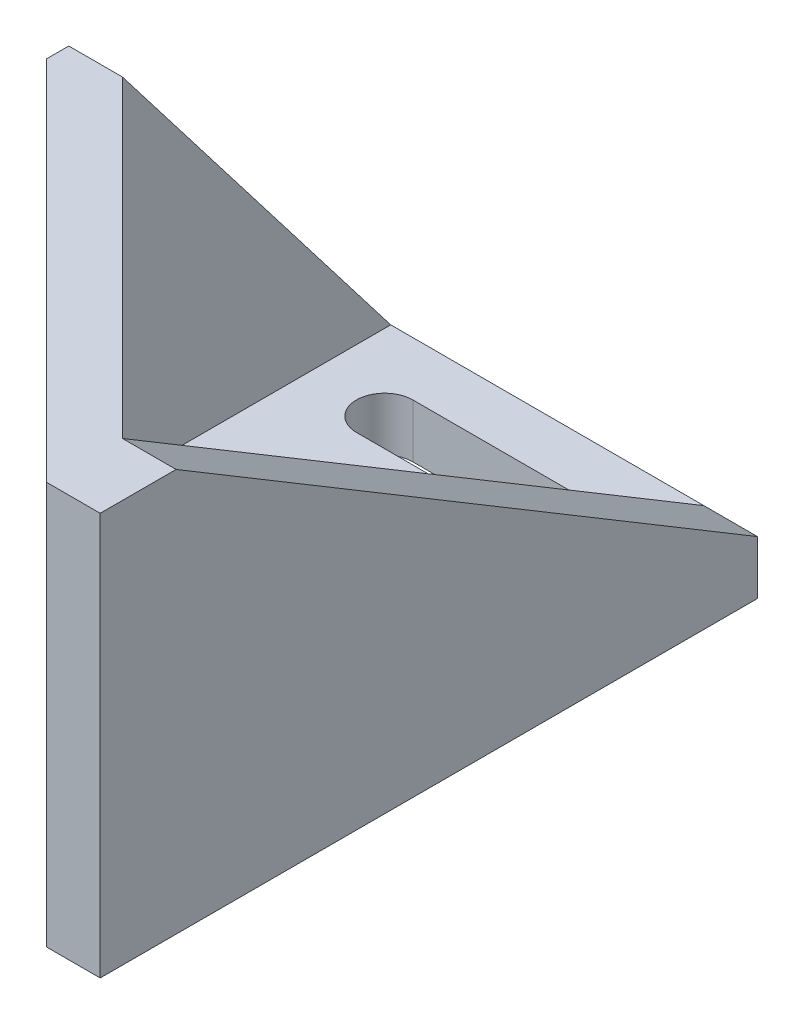
ISO-10303-21;
HEADER;
FILE_DESCRIPTION(('STEP AP214'),'2;1');
FILE_NAME('part.step','',(''),(''),'','','');
FILE_SCHEMA(('AUTOMOTIVE_DESIGN { 1 0 10303 214 1 1 1 1 }'));
ENDSEC;
DATA;
#1=APPLICATION_CONTEXT('core data for automotive mechanical design processes');
#2=APPLICATION_PROTOCOL_DEFINITION('international standard','automotive_design',2000,#1);
#3=PRODUCT_CONTEXT('',#1,'mechanical');
#4=PRODUCT('Part','Part','',(#3));
#5=PRODUCT_RELATED_PRODUCT_CATEGORY('part','',(#4));
#6=PRODUCT_DEFINITION_FORMATION('','',#4);
#7=PRODUCT_DEFINITION_CONTEXT('part definition',#1,'design');
#8=PRODUCT_DEFINITION('design','',#6,#7);
#9=PRODUCT_DEFINITION_SHAPE('','',#8);
#10=(LENGTH_UNIT() NAMED_UNIT(*) SI_UNIT(.MILLI.,.METRE.));
#11=(NAMED_UNIT(*) PLANE_ANGLE_UNIT() SI_UNIT($,.RADIAN.));
#12=(NAMED_UNIT(*) SI_UNIT($,.STERADIAN.) SOLID_ANGLE_UNIT());
#13=UNCERTAINTY_MEASURE_WITH_UNIT(LENGTH_MEASURE(1.E-05),#10,'distance_accuracy_value','');
#14=(GEOMETRIC_REPRESENTATION_CONTEXT(3) GLOBAL_UNCERTAINTY_ASSIGNED_CONTEXT((#13)) GLOBAL_UNIT_ASSIGNED_CONTEXT((#10,
#11,#12)) REPRESENTATION_CONTEXT('',''));
#15=CARTESIAN_POINT('',(0.,0.,0.));
#16=DIRECTION('',(0.,0.,1.));
#17=DIRECTION('',(1.,0.,0.));
#18=AXIS2_PLACEMENT_3D('',#15,#16,#17);
#19=CARTESIAN_POINT('',(-3.32462120245872,15.3749999999991,-1.52462120245878));
#20=DIRECTION('',(-0.707106781186548,0.,0.707106781186547));
#21=DIRECTION('',(0.707106781186547,0.,0.707106781186548));
#22=AXIS2_PLACEMENT_3D('',#19,#20,#21);
#23=CYLINDRICAL_SURFACE('',#22,2.05);
#24=CARTESIAN_POINT('',(-10.2530483272049,15.3749999999991,5.40380592228742));
#25=DIRECTION('',(-0.707106781186548,0.,0.707106781186547));
#26=DIRECTION('',(0.707106781186547,0.,0.707106781186548));
#27=AXIS2_PLACEMENT_3D('',#24,#25,#26);
#28=CIRCLE('',#27,2.05);
#29=CARTESIAN_POINT('',(-8.8034794257725,15.3749999999991,6.85337482371984));
#30=VERTEX_POINT('',#29);
#31=EDGE_CURVE('E397',#30,#30,#28,.T.);
#32=ORIENTED_EDGE('',*,*,#31,.T.);
#33=EDGE_LOOP('',(#32));
#34=FACE_BOUND('',#33,.T.);
#35=CARTESIAN_POINT('',(-8.83883476483183,15.3749999999991,3.98959235991433));
#36=DIRECTION('',(0.707106781186548,0.,-0.707106781186548));
#37=DIRECTION('',(-0.707106781186548,0.,-0.707106781186548));
#38=AXIS2_PLACEMENT_3D('',#35,#36,#37);
#39=CIRCLE('',#38,2.05);
#40=CARTESIAN_POINT('',(-10.2884036662643,15.3749999999991,2.54002345848191));
#41=VERTEX_POINT('',#40);
#42=EDGE_CURVE('E39',#41,#41,#39,.F.);
#43=ORIENTED_EDGE('',*,*,#42,.F.);
#44=EDGE_LOOP('',(#43));
#45=FACE_BOUND('',#44,.T.);
#46=ADVANCED_FACE('F35',(#34,#45),#23,.F.);
#47=CARTESIAN_POINT('',(11.5246212024588,15.3749999999991,13.3246212024587));
#48=DIRECTION('',(-0.707106781186548,0.,0.707106781186547));
#49=DIRECTION('',(0.707106781186547,0.,0.707106781186548));
#50=AXIS2_PLACEMENT_3D('',#47,#48,#49);
#51=CYLINDRICAL_SURFACE('',#50,2.05);
#52=CARTESIAN_POINT('',(4.59619407771259,15.3749999999991,20.2530483272049));
#53=DIRECTION('',(-0.707106781186548,0.,0.707106781186547));
#54=DIRECTION('',(0.707106781186547,0.,0.707106781186548));
#55=AXIS2_PLACEMENT_3D('',#52,#53,#54);
#56=CIRCLE('',#55,2.05);
#57=CARTESIAN_POINT('',(6.04576297914501,15.3749999999991,21.7026172286374));
#58=VERTEX_POINT('',#57);
#59=EDGE_CURVE('E388',#58,#58,#56,.T.);
#60=ORIENTED_EDGE('',*,*,#59,.T.);
#61=EDGE_LOOP('',(#60));
#62=FACE_BOUND('',#61,.T.);
#63=CARTESIAN_POINT('',(6.01040764008569,15.3749999999991,18.8388347648318));
#64=DIRECTION('',(0.707106781186547,0.,-0.707106781186548));
#65=DIRECTION('',(-0.707106781186548,0.,-0.707106781186547));
#66=AXIS2_PLACEMENT_3D('',#63,#64,#65);
#67=CIRCLE('',#66,2.05);
#68=CARTESIAN_POINT('',(4.56083873865326,15.3749999999991,17.3892658633994));
#69=VERTEX_POINT('',#68);
#70=EDGE_CURVE('E320',#69,#69,#67,.F.);
#71=ORIENTED_EDGE('',*,*,#70,.F.);
#72=EDGE_LOOP('',(#71));
#73=FACE_BOUND('',#72,.T.);
#74=ADVANCED_FACE('F475',(#62,#73),#51,.F.);
#75=CARTESIAN_POINT('',(-11.667261889578,4.,-21.6672618895781));
#76=DIRECTION('',(0.,0.,1.));
#77=DIRECTION('',(1.,0.,0.));
#78=AXIS2_PLACEMENT_3D('',#75,#76,#77);
#79=PLANE('',#78);
#80=DIRECTION('',(-1.,0.,0.));
#81=VECTOR('',#80,1.);
#82=CARTESIAN_POINT('',(-11.667261889578,0.,-21.6672618895781));
#83=LINE('',#82,#81);
#84=CARTESIAN_POINT('',(15.667261889578,0.,-21.6672618895781));
#85=VERTEX_POINT('',#84);
#86=CARTESIAN_POINT('',(-15.667261889578,0.,-21.6672618895781));
#87=VERTEX_POINT('',#86);
#88=EDGE_CURVE('E457',#85,#87,#83,.T.);
#89=ORIENTED_EDGE('',*,*,#88,.T.);
#90=DIRECTION('',(0.,-1.,0.));
#91=VECTOR('',#90,1.);
#92=CARTESIAN_POINT('',(-15.667261889578,4.,-21.6672618895781));
#93=LINE('',#92,#91);
#94=CARTESIAN_POINT('',(-15.667261889578,4.,-21.6672618895781));
#95=VERTEX_POINT('',#94);
#96=EDGE_CURVE('E408',#95,#87,#93,.T.);
#97=ORIENTED_EDGE('',*,*,#96,.F.);
#98=DIRECTION('',(1.,0.,0.));
#99=VECTOR('',#98,1.);
#100=CARTESIAN_POINT('',(-15.667261889578,4.,-21.6672618895781));
#101=LINE('',#100,#99);
#102=CARTESIAN_POINT('',(-11.667261889578,4.,-21.6672618895781));
#103=VERTEX_POINT('',#102);
#104=EDGE_CURVE('E414',#95,#103,#101,.T.);
#105=ORIENTED_EDGE('',*,*,#104,.T.);
#106=DIRECTION('',(-1.,0.,0.));
#107=VECTOR('',#106,1.);
#108=CARTESIAN_POINT('',(-11.667261889578,4.,-21.6672618895781));
#109=LINE('',#108,#107);
#110=CARTESIAN_POINT('',(11.667261889578,4.,-21.6672618895781));
#111=VERTEX_POINT('',#110);
#112=EDGE_CURVE('E465',#111,#103,#109,.T.);
#113=ORIENTED_EDGE('',*,*,#112,.F.);
#114=DIRECTION('',(-1.,0.,0.));
#115=VECTOR('',#114,1.);
#116=CARTESIAN_POINT('',(15.667261889578,4.,-21.6672618895781));
#117=LINE('',#116,#115);
#118=CARTESIAN_POINT('',(15.667261889578,4.,-21.6672618895781));
#119=VERTEX_POINT('',#118);
#120=EDGE_CURVE('E440',#119,#111,#117,.T.);
#121=ORIENTED_EDGE('',*,*,#120,.F.);
#122=DIRECTION('',(0.,1.,0.));
#123=VECTOR('',#122,1.);
#124=CARTESIAN_POINT('',(15.667261889578,4.,-21.6672618895781));
#125=LINE('',#124,#123);
#126=EDGE_CURVE('E431',#85,#119,#125,.T.);
#127=ORIENTED_EDGE('',*,*,#126,.F.);
#128=EDGE_LOOP('',(#89,#97,#105,#113,#121,#127));
#129=FACE_BOUND('',#128,.T.);
#130=ADVANCED_FACE('F37',(#129),#79,.F.);
#131=CARTESIAN_POINT('',(0.,4.,0.));
#132=DIRECTION('',(0.,-1.,0.));
#133=DIRECTION('',(0.,0.,-1.));
#134=AXIS2_PLACEMENT_3D('',#131,#132,#133);
#135=PLANE('',#134);
#136=DIRECTION('',(1.,0.,0.));
#137=VECTOR('',#136,1.);
#138=CARTESIAN_POINT('',(-6.,4.,-3.44425381419345));
#139=LINE('',#138,#137);
#140=CARTESIAN_POINT('',(-6.,4.,-3.44425381419345));
#141=VERTEX_POINT('',#140);
#142=CARTESIAN_POINT('',(6.,4.,-3.44425381419345));
#143=VERTEX_POINT('',#142);
#144=EDGE_CURVE('E346',#141,#143,#139,.T.);
#145=ORIENTED_EDGE('',*,*,#144,.F.);
#146=CARTESIAN_POINT('',(-6.,4.,-5.54425381419345));
#147=DIRECTION('',(0.,1.,0.));
#148=DIRECTION('',(0.,0.,1.));
#149=AXIS2_PLACEMENT_3D('',#146,#147,#148);
#150=CIRCLE('',#149,2.1);
#151=CARTESIAN_POINT('',(-6.,4.,-7.64425381419345));
#152=VERTEX_POINT('',#151);
#153=EDGE_CURVE('E344',#152,#141,#150,.T.);
#154=ORIENTED_EDGE('',*,*,#153,.F.);
#155=DIRECTION('',(-1.,0.,0.));
#156=VECTOR('',#155,1.);
#157=CARTESIAN_POINT('',(-6.,4.,-7.64425381419345));
#158=LINE('',#157,#156);
#159=CARTESIAN_POINT('',(6.,4.,-7.64425381419345));
#160=VERTEX_POINT('',#159);
#161=EDGE_CURVE('E334',#160,#152,#158,.T.);
#162=ORIENTED_EDGE('',*,*,#161,.F.);
#163=CARTESIAN_POINT('',(6.,4.,-5.54425381419345));
#164=DIRECTION('',(0.,1.,0.));
#165=DIRECTION('',(0.,0.,1.));
#166=AXIS2_PLACEMENT_3D('',#163,#164,#165);
#167=CIRCLE('',#166,2.1);
#168=EDGE_CURVE('E349',#143,#160,#167,.T.);
#169=ORIENTED_EDGE('',*,*,#168,.F.);
#170=EDGE_LOOP('',(#145,#154,#162,#169));
#171=FACE_BOUND('',#170,.T.);
#172=DIRECTION('',(1.,0.,0.));
#173=VECTOR('',#172,1.);
#174=CARTESIAN_POINT('',(-6.,4.,-13.4442538141935));
#175=LINE('',#174,#173);
#176=CARTESIAN_POINT('',(-6.,4.,-13.4442538141935));
#177=VERTEX_POINT('',#176);
#178=CARTESIAN_POINT('',(6.,4.,-13.4442538141935));
#179=VERTEX_POINT('',#178);
#180=EDGE_CURVE('E378',#177,#179,#175,.T.);
#181=ORIENTED_EDGE('',*,*,#180,.F.);
#182=CARTESIAN_POINT('',(-6.,4.,-15.5442538141935));
#183=DIRECTION('',(0.,1.,0.));
#184=DIRECTION('',(0.,0.,1.));
#185=AXIS2_PLACEMENT_3D('',#182,#183,#184);
#186=CIRCLE('',#185,2.1);
#187=CARTESIAN_POINT('',(-6.,4.,-17.6442538141935));
#188=VERTEX_POINT('',#187);
#189=EDGE_CURVE('E356',#188,#177,#186,.T.);
#190=ORIENTED_EDGE('',*,*,#189,.F.);
#191=DIRECTION('',(-1.,0.,0.));
#192=VECTOR('',#191,1.);
#193=CARTESIAN_POINT('',(-6.,4.,-17.6442538141935));
#194=LINE('',#193,#192);
#195=CARTESIAN_POINT('',(6.,4.,-17.6442538141935));
#196=VERTEX_POINT('',#195);
#197=EDGE_CURVE('E367',#196,#188,#194,.T.);
#198=ORIENTED_EDGE('',*,*,#197,.F.);
#199=CARTESIAN_POINT('',(6.,4.,-15.5442538141935));
#200=DIRECTION('',(0.,1.,0.));
#201=DIRECTION('',(0.,0.,1.));
#202=AXIS2_PLACEMENT_3D('',#199,#200,#201);
#203=CIRCLE('',#202,2.1);
#204=EDGE_CURVE('E381',#179,#196,#203,.T.);
#205=ORIENTED_EDGE('',*,*,#204,.F.);
#206=EDGE_LOOP('',(#181,#190,#198,#205));
#207=FACE_BOUND('',#206,.T.);
#208=DIRECTION('',(0.,0.,-1.));
#209=VECTOR('',#208,1.);
#210=CARTESIAN_POINT('',(11.667261889578,4.,21.6672618895781));
#211=LINE('',#210,#209);
#212=CARTESIAN_POINT('',(11.667261889578,4.,21.6672618895781));
#213=VERTEX_POINT('',#212);
#214=EDGE_CURVE('E462',#213,#111,#211,.T.);
#215=ORIENTED_EDGE('',*,*,#214,.T.);
#216=ORIENTED_EDGE('',*,*,#112,.T.);
#217=DIRECTION('',(0.,0.,1.));
#218=VECTOR('',#217,1.);
#219=CARTESIAN_POINT('',(-11.667261889578,4.,-21.6672618895781));
#220=LINE('',#219,#218);
#221=CARTESIAN_POINT('',(-11.667261889578,4.,-1.66726188957805));
#222=VERTEX_POINT('',#221);
#223=EDGE_CURVE('E44',#103,#222,#220,.T.);
#224=ORIENTED_EDGE('',*,*,#223,.T.);
#225=DIRECTION('',(0.707106781186546,0.,0.707106781186549));
#226=VECTOR('',#225,1.);
#227=CARTESIAN_POINT('',(-11.667261889578,4.,-1.66726188957805));
#228=LINE('',#227,#226);
#229=EDGE_CURVE('E11',#222,#213,#228,.T.);
#230=ORIENTED_EDGE('',*,*,#229,.T.);
#231=EDGE_LOOP('',(#215,#216,#224,#230));
#232=FACE_BOUND('',#231,.T.);
#233=ADVANCED_FACE('F483',(#171,#207,#232),#135,.F.);
#234=CARTESIAN_POINT('',(0.,0.,0.));
#235=DIRECTION('',(0.,-1.,0.));
#236=DIRECTION('',(0.,0.,-1.));
#237=AXIS2_PLACEMENT_3D('',#234,#235,#236);
#238=PLANE('',#237);
#239=CARTESIAN_POINT('',(-6.,0.,-5.54425381419345));
#240=DIRECTION('',(0.,1.,0.));
#241=DIRECTION('',(0.,0.,1.));
#242=AXIS2_PLACEMENT_3D('',#239,#240,#241);
#243=CIRCLE('',#242,2.1);
#244=CARTESIAN_POINT('',(-6.,0.,-7.64425381419345));
#245=VERTEX_POINT('',#244);
#246=CARTESIAN_POINT('',(-6.,0.,-3.44425381419345));
#247=VERTEX_POINT('',#246);
#248=EDGE_CURVE('E330',#245,#247,#243,.T.);
#249=ORIENTED_EDGE('',*,*,#248,.T.);
#250=DIRECTION('',(1.,0.,0.));
#251=VECTOR('',#250,1.);
#252=CARTESIAN_POINT('',(-6.,0.,-3.44425381419345));
#253=LINE('',#252,#251);
#254=CARTESIAN_POINT('',(6.,0.,-3.44425381419345));
#255=VERTEX_POINT('',#254);
#256=EDGE_CURVE('E333',#247,#255,#253,.T.);
#257=ORIENTED_EDGE('',*,*,#256,.T.);
#258=CARTESIAN_POINT('',(6.,0.,-5.54425381419345));
#259=DIRECTION('',(0.,1.,0.));
#260=DIRECTION('',(0.,0.,1.));
#261=AXIS2_PLACEMENT_3D('',#258,#259,#260);
#262=CIRCLE('',#261,2.1);
#263=CARTESIAN_POINT('',(6.,0.,-7.64425381419345));
#264=VERTEX_POINT('',#263);
#265=EDGE_CURVE('E337',#255,#264,#262,.T.);
#266=ORIENTED_EDGE('',*,*,#265,.T.);
#267=DIRECTION('',(-1.,0.,0.));
#268=VECTOR('',#267,1.);
#269=CARTESIAN_POINT('',(-6.,0.,-7.64425381419345));
#270=LINE('',#269,#268);
#271=EDGE_CURVE('E340',#264,#245,#270,.T.);
#272=ORIENTED_EDGE('',*,*,#271,.T.);
#273=EDGE_LOOP('',(#249,#257,#266,#272));
#274=FACE_BOUND('',#273,.T.);
#275=CARTESIAN_POINT('',(-6.,0.,-15.5442538141935));
#276=DIRECTION('',(0.,1.,0.));
#277=DIRECTION('',(0.,0.,1.));
#278=AXIS2_PLACEMENT_3D('',#275,#276,#277);
#279=CIRCLE('',#278,2.1);
#280=CARTESIAN_POINT('',(-6.,0.,-17.6442538141935));
#281=VERTEX_POINT('',#280);
#282=CARTESIAN_POINT('',(-6.,0.,-13.4442538141935));
#283=VERTEX_POINT('',#282);
#284=EDGE_CURVE('E363',#281,#283,#279,.T.);
#285=ORIENTED_EDGE('',*,*,#284,.T.);
#286=DIRECTION('',(1.,0.,0.));
#287=VECTOR('',#286,1.);
#288=CARTESIAN_POINT('',(-6.,0.,-13.4442538141935));
#289=LINE('',#288,#287);
#290=CARTESIAN_POINT('',(6.,0.,-13.4442538141935));
#291=VERTEX_POINT('',#290);
#292=EDGE_CURVE('E366',#283,#291,#289,.T.);
#293=ORIENTED_EDGE('',*,*,#292,.T.);
#294=CARTESIAN_POINT('',(6.,0.,-15.5442538141935));
#295=DIRECTION('',(0.,1.,0.));
#296=DIRECTION('',(0.,0.,1.));
#297=AXIS2_PLACEMENT_3D('',#294,#295,#296);
#298=CIRCLE('',#297,2.1);
#299=CARTESIAN_POINT('',(6.,0.,-17.6442538141935));
#300=VERTEX_POINT('',#299);
#301=EDGE_CURVE('E370',#291,#300,#298,.T.);
#302=ORIENTED_EDGE('',*,*,#301,.T.);
#303=DIRECTION('',(-1.,0.,0.));
#304=VECTOR('',#303,1.);
#305=CARTESIAN_POINT('',(-6.,0.,-17.6442538141935));
#306=LINE('',#305,#304);
#307=EDGE_CURVE('E373',#300,#281,#306,.T.);
#308=ORIENTED_EDGE('',*,*,#307,.T.);
#309=EDGE_LOOP('',(#285,#293,#302,#308));
#310=FACE_BOUND('',#309,.T.);
#311=DIRECTION('',(-0.707106781186547,0.,-0.707106781186548));
#312=VECTOR('',#311,1.);
#313=CARTESIAN_POINT('',(-11.667261889578,0.,3.98959235991432));
#314=LINE('',#313,#312);
#315=CARTESIAN_POINT('',(11.667261889578,0.,27.3241161390704));
#316=VERTEX_POINT('',#315);
#317=CARTESIAN_POINT('',(-15.667261889578,0.,-0.0104076400856811));
#318=VERTEX_POINT('',#317);
#319=EDGE_CURVE('E447',#316,#318,#314,.T.);
#320=ORIENTED_EDGE('',*,*,#319,.T.);
#321=DIRECTION('',(0.,0.,1.));
#322=VECTOR('',#321,1.);
#323=CARTESIAN_POINT('',(-15.667261889578,0.,-21.6672618895781));
#324=LINE('',#323,#322);
#325=EDGE_CURVE('E411',#87,#318,#324,.T.);
#326=ORIENTED_EDGE('',*,*,#325,.F.);
#327=ORIENTED_EDGE('',*,*,#88,.F.);
#328=DIRECTION('',(0.,0.,-1.));
#329=VECTOR('',#328,1.);
#330=CARTESIAN_POINT('',(15.667261889578,0.,27.3241161390704));
#331=LINE('',#330,#329);
#332=CARTESIAN_POINT('',(15.667261889578,0.,27.3241161390704));
#333=VERTEX_POINT('',#332);
#334=EDGE_CURVE('E428',#333,#85,#331,.T.);
#335=ORIENTED_EDGE('',*,*,#334,.F.);
#336=DIRECTION('',(-1.,0.,0.));
#337=VECTOR('',#336,1.);
#338=CARTESIAN_POINT('',(15.667261889578,0.,27.3241161390704));
#339=LINE('',#338,#337);
#340=EDGE_CURVE('E442',#333,#316,#339,.T.);
#341=ORIENTED_EDGE('',*,*,#340,.T.);
#342=EDGE_LOOP('',(#320,#326,#327,#335,#341));
#343=FACE_BOUND('',#342,.T.);
#344=ADVANCED_FACE('F530',(#274,#310,#343),#238,.T.);
#345=CARTESIAN_POINT('',(11.667261889578,30.,21.667261889578));
#346=DIRECTION('',(0.707106781186547,0.,-0.707106781186547));
#347=DIRECTION('',(-0.707106781186548,0.,-0.707106781186548));
#348=AXIS2_PLACEMENT_3D('',#345,#346,#347);
#349=PLANE('',#348);
#350=DIRECTION('',(0.353553390593274,-0.866025403784439,0.353553390593274));
#351=VECTOR('',#350,1.);
#352=CARTESIAN_POINT('',(-6.0161646003584,18.8249999999991,3.98383539964156));
#353=LINE('',#352,#351);
#354=CARTESIAN_POINT('',(-6.0161646003584,18.8249999999991,3.98383539964156));
#355=VERTEX_POINT('',#354);
#356=CARTESIAN_POINT('',(-4.60770799825808,15.3749999999991,5.39229200174189));
#357=VERTEX_POINT('',#356);
#358=EDGE_CURVE('E52',#355,#357,#353,.T.);
#359=ORIENTED_EDGE('',*,*,#358,.F.);
#360=DIRECTION('',(0.707106781186547,0.,0.707106781186548));
#361=VECTOR('',#360,1.);
#362=CARTESIAN_POINT('',(-8.83307780455906,18.8249999999991,1.16692219544091));
#363=LINE('',#362,#361);
#364=CARTESIAN_POINT('',(-8.83307780455906,18.8249999999991,1.16692219544091));
#365=VERTEX_POINT('',#364);
#366=EDGE_CURVE('E250',#365,#355,#363,.T.);
#367=ORIENTED_EDGE('',*,*,#366,.F.);
#368=DIRECTION('',(0.353553390593274,0.866025403784439,0.353553390593274));
#369=VECTOR('',#368,1.);
#370=CARTESIAN_POINT('',(-10.2415344066594,15.3749999999991,-0.24153440665942));
#371=LINE('',#370,#369);
#372=CARTESIAN_POINT('',(-10.2415344066594,15.3749999999991,-0.24153440665942));
#373=VERTEX_POINT('',#372);
#374=EDGE_CURVE('E253',#373,#365,#371,.T.);
#375=ORIENTED_EDGE('',*,*,#374,.F.);
#376=DIRECTION('',(-0.353553390593273,0.866025403784439,-0.353553390593273));
#377=VECTOR('',#376,1.);
#378=CARTESIAN_POINT('',(-8.83307780455906,11.9249999999991,1.16692219544091));
#379=LINE('',#378,#377);
#380=CARTESIAN_POINT('',(-8.83307780455906,11.9249999999991,1.16692219544091));
#381=VERTEX_POINT('',#380);
#382=EDGE_CURVE('E269',#381,#373,#379,.T.);
#383=ORIENTED_EDGE('',*,*,#382,.F.);
#384=DIRECTION('',(-0.707106781186548,0.,-0.707106781186548));
#385=VECTOR('',#384,1.);
#386=CARTESIAN_POINT('',(-6.0161646003584,11.9249999999991,3.98383539964156));
#387=LINE('',#386,#385);
#388=CARTESIAN_POINT('',(-6.0161646003584,11.9249999999991,3.98383539964156));
#389=VERTEX_POINT('',#388);
#390=EDGE_CURVE('E266',#389,#381,#387,.T.);
#391=ORIENTED_EDGE('',*,*,#390,.F.);
#392=DIRECTION('',(-0.353553390593274,-0.866025403784439,-0.353553390593274));
#393=VECTOR('',#392,1.);
#394=CARTESIAN_POINT('',(-4.60770799825808,15.3749999999991,5.39229200174189));
#395=LINE('',#394,#393);
#396=EDGE_CURVE('E264',#357,#389,#395,.T.);
#397=ORIENTED_EDGE('',*,*,#396,.F.);
#398=EDGE_LOOP('',(#359,#367,#375,#383,#391,#397));
#399=FACE_BOUND('',#398,.T.);
#400=DIRECTION('',(-0.353553390593273,0.866025403784439,-0.353553390593273));
#401=VECTOR('',#400,1.);
#402=CARTESIAN_POINT('',(6.01616460035846,11.9249999999991,16.0161646003584));
#403=LINE('',#402,#401);
#404=CARTESIAN_POINT('',(6.01616460035846,11.9249999999991,16.0161646003584));
#405=VERTEX_POINT('',#404);
#406=CARTESIAN_POINT('',(4.60770799825813,15.3749999999991,14.6077079982581));
#407=VERTEX_POINT('',#406);
#408=EDGE_CURVE('E60',#405,#407,#403,.T.);
#409=ORIENTED_EDGE('',*,*,#408,.F.);
#410=DIRECTION('',(-0.707106781186547,0.,-0.707106781186548));
#411=VECTOR('',#410,1.);
#412=CARTESIAN_POINT('',(8.83307780455911,11.9249999999991,18.8330778045591));
#413=LINE('',#412,#411);
#414=CARTESIAN_POINT('',(8.83307780455911,11.9249999999991,18.8330778045591));
#415=VERTEX_POINT('',#414);
#416=EDGE_CURVE('E287',#415,#405,#413,.T.);
#417=ORIENTED_EDGE('',*,*,#416,.F.);
#418=DIRECTION('',(-0.353553390593274,-0.866025403784438,-0.353553390593274));
#419=VECTOR('',#418,1.);
#420=CARTESIAN_POINT('',(10.2415344066594,15.3749999999991,20.2415344066594));
#421=LINE('',#420,#419);
#422=CARTESIAN_POINT('',(10.2415344066594,15.3749999999991,20.2415344066594));
#423=VERTEX_POINT('',#422);
#424=EDGE_CURVE('E313',#423,#415,#421,.T.);
#425=ORIENTED_EDGE('',*,*,#424,.F.);
#426=DIRECTION('',(0.353553390593274,-0.866025403784438,0.353553390593274));
#427=VECTOR('',#426,1.);
#428=CARTESIAN_POINT('',(8.83307780455911,18.8249999999991,18.8330778045591));
#429=LINE('',#428,#427);
#430=CARTESIAN_POINT('',(8.83307780455911,18.8249999999991,18.8330778045591));
#431=VERTEX_POINT('',#430);
#432=EDGE_CURVE('E310',#431,#423,#429,.T.);
#433=ORIENTED_EDGE('',*,*,#432,.F.);
#434=DIRECTION('',(0.707106781186547,0.,0.707106781186548));
#435=VECTOR('',#434,1.);
#436=CARTESIAN_POINT('',(6.01616460035845,18.8249999999991,16.0161646003584));
#437=LINE('',#436,#435);
#438=CARTESIAN_POINT('',(6.01616460035845,18.8249999999991,16.0161646003584));
#439=VERTEX_POINT('',#438);
#440=EDGE_CURVE('E307',#439,#431,#437,.T.);
#441=ORIENTED_EDGE('',*,*,#440,.F.);
#442=DIRECTION('',(0.353553390593274,0.866025403784439,0.353553390593273));
#443=VECTOR('',#442,1.);
#444=CARTESIAN_POINT('',(4.60770799825813,15.3749999999991,14.6077079982581));
#445=LINE('',#444,#443);
#446=EDGE_CURVE('E304',#407,#439,#445,.T.);
#447=ORIENTED_EDGE('',*,*,#446,.F.);
#448=EDGE_LOOP('',(#409,#417,#425,#433,#441,#447));
#449=FACE_BOUND('',#448,.T.);
#450=ORIENTED_EDGE('',*,*,#229,.F.);
#451=DIRECTION('',(0.,-1.,0.));
#452=VECTOR('',#451,1.);
#453=CARTESIAN_POINT('',(-11.667261889578,30.,-1.66726188957805));
#454=LINE('',#453,#452);
#455=CARTESIAN_POINT('',(-11.667261889578,30.,-1.66726188957805));
#456=VERTEX_POINT('',#455);
#457=EDGE_CURVE('E455',#456,#222,#454,.T.);
#458=ORIENTED_EDGE('',*,*,#457,.F.);
#459=DIRECTION('',(0.707106781186548,0.,0.707106781186548));
#460=VECTOR('',#459,1.);
#461=CARTESIAN_POINT('',(11.667261889578,30.,21.667261889578));
#462=LINE('',#461,#460);
#463=CARTESIAN_POINT('',(11.667261889578,30.,21.667261889578));
#464=VERTEX_POINT('',#463);
#465=EDGE_CURVE('E448',#456,#464,#462,.T.);
#466=ORIENTED_EDGE('',*,*,#465,.T.);
#467=DIRECTION('',(0.,-1.,0.));
#468=VECTOR('',#467,1.);
#469=CARTESIAN_POINT('',(11.667261889578,30.,21.667261889578));
#470=LINE('',#469,#468);
#471=EDGE_CURVE('E453',#464,#213,#470,.T.);
#472=ORIENTED_EDGE('',*,*,#471,.T.);
#473=EDGE_LOOP('',(#450,#458,#466,#472));
#474=FACE_BOUND('',#473,.T.);
#475=ADVANCED_FACE('F526',(#399,#449,#474),#349,.T.);
#476=CARTESIAN_POINT('',(-11.667261889578,30.,3.98959235991432));
#477=DIRECTION('',(-0.707106781186548,0.,0.707106781186547));
#478=DIRECTION('',(0.707106781186547,0.,0.707106781186548));
#479=AXIS2_PLACEMENT_3D('',#476,#477,#478);
#480=PLANE('',#479);
#481=ORIENTED_EDGE('',*,*,#59,.F.);
#482=EDGE_LOOP('',(#481));
#483=FACE_BOUND('',#482,.T.);
#484=ORIENTED_EDGE('',*,*,#31,.F.);
#485=EDGE_LOOP('',(#484));
#486=FACE_BOUND('',#485,.T.);
#487=ORIENTED_EDGE('',*,*,#319,.F.);
#488=DIRECTION('',(0.,-1.,0.));
#489=VECTOR('',#488,1.);
#490=CARTESIAN_POINT('',(11.667261889578,30.,27.3241161390704));
#491=LINE('',#490,#489);
#492=CARTESIAN_POINT('',(11.667261889578,30.,27.3241161390704));
#493=VERTEX_POINT('',#492);
#494=EDGE_CURVE('E458',#493,#316,#491,.T.);
#495=ORIENTED_EDGE('',*,*,#494,.F.);
#496=DIRECTION('',(-0.707106781186547,0.,-0.707106781186548));
#497=VECTOR('',#496,1.);
#498=CARTESIAN_POINT('',(-11.667261889578,30.,3.98959235991432));
#499=LINE('',#498,#497);
#500=CARTESIAN_POINT('',(-15.667261889578,30.,-0.0104076400856811));
#501=VERTEX_POINT('',#500);
#502=EDGE_CURVE('E451',#493,#501,#499,.T.);
#503=ORIENTED_EDGE('',*,*,#502,.T.);
#504=DIRECTION('',(0.,1.,0.));
#505=VECTOR('',#504,1.);
#506=CARTESIAN_POINT('',(-15.667261889578,0.,-0.0104076400856811));
#507=LINE('',#506,#505);
#508=EDGE_CURVE('E400',#318,#501,#507,.T.);
#509=ORIENTED_EDGE('',*,*,#508,.F.);
#510=EDGE_LOOP('',(#487,#495,#503,#509));
#511=FACE_BOUND('',#510,.T.);
#512=ADVANCED_FACE('F522',(#483,#486,#511),#480,.T.);
#513=CARTESIAN_POINT('',(0.,30.,0.));
#514=DIRECTION('',(0.,1.,0.));
#515=DIRECTION('',(0.,0.,1.));
#516=AXIS2_PLACEMENT_3D('',#513,#514,#515);
#517=PLANE('',#516);
#518=DIRECTION('',(0.,0.,-1.));
#519=VECTOR('',#518,1.);
#520=CARTESIAN_POINT('',(-15.667261889578,30.,3.98959235991432));
#521=LINE('',#520,#519);
#522=CARTESIAN_POINT('',(-15.667261889578,30.,-1.66726188957805));
#523=VERTEX_POINT('',#522);
#524=EDGE_CURVE('E404',#501,#523,#521,.T.);
#525=ORIENTED_EDGE('',*,*,#524,.F.);
#526=ORIENTED_EDGE('',*,*,#502,.F.);
#527=DIRECTION('',(-1.,0.,0.));
#528=VECTOR('',#527,1.);
#529=CARTESIAN_POINT('',(15.667261889578,30.,27.3241161390704));
#530=LINE('',#529,#528);
#531=CARTESIAN_POINT('',(15.667261889578,30.,27.3241161390704));
#532=VERTEX_POINT('',#531);
#533=EDGE_CURVE('E445',#532,#493,#530,.T.);
#534=ORIENTED_EDGE('',*,*,#533,.F.);
#535=DIRECTION('',(0.,0.,1.));
#536=VECTOR('',#535,1.);
#537=CARTESIAN_POINT('',(15.667261889578,30.,21.667261889578));
#538=LINE('',#537,#536);
#539=CARTESIAN_POINT('',(15.667261889578,30.,21.667261889578));
#540=VERTEX_POINT('',#539);
#541=EDGE_CURVE('E423',#540,#532,#538,.T.);
#542=ORIENTED_EDGE('',*,*,#541,.F.);
#543=DIRECTION('',(-1.,0.,0.));
#544=VECTOR('',#543,1.);
#545=CARTESIAN_POINT('',(15.667261889578,30.,21.667261889578));
#546=LINE('',#545,#544);
#547=EDGE_CURVE('E435',#540,#464,#546,.T.);
#548=ORIENTED_EDGE('',*,*,#547,.T.);
#549=ORIENTED_EDGE('',*,*,#465,.F.);
#550=DIRECTION('',(1.,0.,0.));
#551=VECTOR('',#550,1.);
#552=CARTESIAN_POINT('',(-15.667261889578,30.,-1.66726188957805));
#553=LINE('',#552,#551);
#554=EDGE_CURVE('E419',#523,#456,#553,.T.);
#555=ORIENTED_EDGE('',*,*,#554,.F.);
#556=EDGE_LOOP('',(#525,#526,#534,#542,#548,#549,#555));
#557=FACE_BOUND('',#556,.T.);
#558=ADVANCED_FACE('F518',(#557),#517,.T.);
#559=CARTESIAN_POINT('',(15.667261889578,30.,27.3241161390704));
#560=DIRECTION('',(0.,0.,-1.));
#561=DIRECTION('',(-1.,0.,0.));
#562=AXIS2_PLACEMENT_3D('',#559,#560,#561);
#563=PLANE('',#562);
#564=ORIENTED_EDGE('',*,*,#494,.T.);
#565=ORIENTED_EDGE('',*,*,#340,.F.);
#566=DIRECTION('',(0.,-1.,0.));
#567=VECTOR('',#566,1.);
#568=CARTESIAN_POINT('',(15.667261889578,30.,27.3241161390704));
#569=LINE('',#568,#567);
#570=EDGE_CURVE('E426',#532,#333,#569,.T.);
#571=ORIENTED_EDGE('',*,*,#570,.F.);
#572=ORIENTED_EDGE('',*,*,#533,.T.);
#573=EDGE_LOOP('',(#564,#565,#571,#572));
#574=FACE_BOUND('',#573,.T.);
#575=ADVANCED_FACE('F514',(#574),#563,.F.);
#576=CARTESIAN_POINT('',(15.667261889578,30.,21.667261889578));
#577=DIRECTION('',(0.,-0.857499161172824,0.514485362850978));
#578=DIRECTION('',(0.,-0.514485362850978,-0.857499161172824));
#579=AXIS2_PLACEMENT_3D('',#576,#577,#578);
#580=PLANE('',#579);
#581=DIRECTION('',(0.,0.514485362850978,0.857499161172824));
#582=VECTOR('',#581,1.);
#583=CARTESIAN_POINT('',(11.667261889578,30.,21.667261889578));
#584=LINE('',#583,#582);
#585=EDGE_CURVE('E422',#111,#464,#584,.T.);
#586=ORIENTED_EDGE('',*,*,#585,.T.);
#587=ORIENTED_EDGE('',*,*,#547,.F.);
#588=DIRECTION('',(0.,0.514485362850978,0.857499161172824));
#589=VECTOR('',#588,1.);
#590=CARTESIAN_POINT('',(15.667261889578,30.,21.667261889578));
#591=LINE('',#590,#589);
#592=EDGE_CURVE('E433',#119,#540,#591,.T.);
#593=ORIENTED_EDGE('',*,*,#592,.F.);
#594=ORIENTED_EDGE('',*,*,#120,.T.);
#595=EDGE_LOOP('',(#586,#587,#593,#594));
#596=FACE_BOUND('',#595,.T.);
#597=ADVANCED_FACE('F507',(#596),#580,.F.);
#598=CARTESIAN_POINT('',(15.667261889578,0.,0.));
#599=DIRECTION('',(1.,0.,0.));
#600=DIRECTION('',(0.,0.,-1.));
#601=AXIS2_PLACEMENT_3D('',#598,#599,#600);
#602=PLANE('',#601);
#603=ORIENTED_EDGE('',*,*,#541,.T.);
#604=ORIENTED_EDGE('',*,*,#570,.T.);
#605=ORIENTED_EDGE('',*,*,#334,.T.);
#606=ORIENTED_EDGE('',*,*,#126,.T.);
#607=ORIENTED_EDGE('',*,*,#592,.T.);
#608=EDGE_LOOP('',(#603,#604,#605,#606,#607));
#609=FACE_BOUND('',#608,.T.);
#610=ADVANCED_FACE('F504',(#609),#602,.T.);
#611=CARTESIAN_POINT('',(11.667261889578,0.,0.));
#612=DIRECTION('',(1.,0.,0.));
#613=DIRECTION('',(0.,0.,-1.));
#614=AXIS2_PLACEMENT_3D('',#611,#612,#613);
#615=PLANE('',#614);
#616=ORIENTED_EDGE('',*,*,#214,.F.);
#617=ORIENTED_EDGE('',*,*,#471,.F.);
#618=ORIENTED_EDGE('',*,*,#585,.F.);
#619=EDGE_LOOP('',(#616,#617,#618));
#620=FACE_BOUND('',#619,.T.);
#621=ADVANCED_FACE('F499',(#620),#615,.F.);
#622=CARTESIAN_POINT('',(-11.667261889578,0.,0.));
#623=DIRECTION('',(-1.,0.,0.));
#624=DIRECTION('',(0.,0.,1.));
#625=AXIS2_PLACEMENT_3D('',#622,#623,#624);
#626=PLANE('',#625);
#627=DIRECTION('',(0.,-0.7926239891046,-0.609710760849692));
#628=VECTOR('',#627,1.);
#629=CARTESIAN_POINT('',(-11.667261889578,30.,-1.66726188957805));
#630=LINE('',#629,#628);
#631=EDGE_CURVE('E403',#456,#103,#630,.T.);
#632=ORIENTED_EDGE('',*,*,#631,.F.);
#633=ORIENTED_EDGE('',*,*,#457,.T.);
#634=ORIENTED_EDGE('',*,*,#223,.F.);
#635=EDGE_LOOP('',(#632,#633,#634));
#636=FACE_BOUND('',#635,.T.);
#637=ADVANCED_FACE('F496',(#636),#626,.F.);
#638=CARTESIAN_POINT('',(-15.667261889578,30.,-1.66726188957805));
#639=DIRECTION('',(0.,-0.609710760849692,0.7926239891046));
#640=DIRECTION('',(0.,-0.7926239891046,-0.609710760849692));
#641=AXIS2_PLACEMENT_3D('',#638,#639,#640);
#642=PLANE('',#641);
#643=ORIENTED_EDGE('',*,*,#631,.T.);
#644=ORIENTED_EDGE('',*,*,#104,.F.);
#645=DIRECTION('',(0.,-0.7926239891046,-0.609710760849692));
#646=VECTOR('',#645,1.);
#647=CARTESIAN_POINT('',(-15.667261889578,30.,-1.66726188957805));
#648=LINE('',#647,#646);
#649=EDGE_CURVE('E406',#523,#95,#648,.T.);
#650=ORIENTED_EDGE('',*,*,#649,.F.);
#651=ORIENTED_EDGE('',*,*,#554,.T.);
#652=EDGE_LOOP('',(#643,#644,#650,#651));
#653=FACE_BOUND('',#652,.T.);
#654=ADVANCED_FACE('F494',(#653),#642,.F.);
#655=CARTESIAN_POINT('',(-15.667261889578,0.,0.));
#656=DIRECTION('',(-1.,0.,0.));
#657=DIRECTION('',(0.,0.,1.));
#658=AXIS2_PLACEMENT_3D('',#655,#656,#657);
#659=PLANE('',#658);
#660=ORIENTED_EDGE('',*,*,#508,.T.);
#661=ORIENTED_EDGE('',*,*,#524,.T.);
#662=ORIENTED_EDGE('',*,*,#649,.T.);
#663=ORIENTED_EDGE('',*,*,#96,.T.);
#664=ORIENTED_EDGE('',*,*,#325,.T.);
#665=EDGE_LOOP('',(#660,#661,#662,#663,#664));
#666=FACE_BOUND('',#665,.T.);
#667=ADVANCED_FACE('F491',(#666),#659,.T.);
#668=CARTESIAN_POINT('',(-6.,0.,-15.5442538141935));
#669=DIRECTION('',(0.,1.,0.));
#670=DIRECTION('',(0.,0.,1.));
#671=AXIS2_PLACEMENT_3D('',#668,#669,#670);
#672=CYLINDRICAL_SURFACE('',#671,2.1);
#673=ORIENTED_EDGE('',*,*,#189,.T.);
#674=DIRECTION('',(0.,1.,0.));
#675=VECTOR('',#674,1.);
#676=CARTESIAN_POINT('',(-6.,0.,-13.4442538141935));
#677=LINE('',#676,#675);
#678=EDGE_CURVE('E376',#283,#177,#677,.T.);
#679=ORIENTED_EDGE('',*,*,#678,.F.);
#680=ORIENTED_EDGE('',*,*,#284,.F.);
#681=DIRECTION('',(0.,1.,0.));
#682=VECTOR('',#681,1.);
#683=CARTESIAN_POINT('',(-6.,0.,-17.6442538141935));
#684=LINE('',#683,#682);
#685=EDGE_CURVE('E386',#281,#188,#684,.T.);
#686=ORIENTED_EDGE('',*,*,#685,.T.);
#687=EDGE_LOOP('',(#673,#679,#680,#686));
#688=FACE_BOUND('',#687,.T.);
#689=ADVANCED_FACE('F488',(#688),#672,.F.);
#690=CARTESIAN_POINT('',(-6.,0.,-17.6442538141935));
#691=DIRECTION('',(0.,0.,-1.));
#692=DIRECTION('',(-1.,0.,0.));
#693=AXIS2_PLACEMENT_3D('',#690,#691,#692);
#694=PLANE('',#693);
#695=ORIENTED_EDGE('',*,*,#197,.T.);
#696=ORIENTED_EDGE('',*,*,#685,.F.);
#697=ORIENTED_EDGE('',*,*,#307,.F.);
#698=DIRECTION('',(0.,1.,0.));
#699=VECTOR('',#698,1.);
#700=CARTESIAN_POINT('',(6.,0.,-17.6442538141935));
#701=LINE('',#700,#699);
#702=EDGE_CURVE('E389',#300,#196,#701,.T.);
#703=ORIENTED_EDGE('',*,*,#702,.T.);
#704=EDGE_LOOP('',(#695,#696,#697,#703));
#705=FACE_BOUND('',#704,.T.);
#706=ADVANCED_FACE('F581',(#705),#694,.F.);
#707=CARTESIAN_POINT('',(6.,0.,-15.5442538141935));
#708=DIRECTION('',(0.,1.,0.));
#709=DIRECTION('',(0.,0.,1.));
#710=AXIS2_PLACEMENT_3D('',#707,#708,#709);
#711=CYLINDRICAL_SURFACE('',#710,2.1);
#712=ORIENTED_EDGE('',*,*,#204,.T.);
#713=ORIENTED_EDGE('',*,*,#702,.F.);
#714=ORIENTED_EDGE('',*,*,#301,.F.);
#715=DIRECTION('',(0.,1.,0.));
#716=VECTOR('',#715,1.);
#717=CARTESIAN_POINT('',(6.,0.,-13.4442538141935));
#718=LINE('',#717,#716);
#719=EDGE_CURVE('E391',#291,#179,#718,.T.);
#720=ORIENTED_EDGE('',*,*,#719,.T.);
#721=EDGE_LOOP('',(#712,#713,#714,#720));
#722=FACE_BOUND('',#721,.T.);
#723=ADVANCED_FACE('F578',(#722),#711,.F.);
#724=CARTESIAN_POINT('',(-6.,0.,-13.4442538141935));
#725=DIRECTION('',(0.,0.,1.));
#726=DIRECTION('',(1.,0.,0.));
#727=AXIS2_PLACEMENT_3D('',#724,#725,#726);
#728=PLANE('',#727);
#729=ORIENTED_EDGE('',*,*,#180,.T.);
#730=ORIENTED_EDGE('',*,*,#719,.F.);
#731=ORIENTED_EDGE('',*,*,#292,.F.);
#732=ORIENTED_EDGE('',*,*,#678,.T.);
#733=EDGE_LOOP('',(#729,#730,#731,#732));
#734=FACE_BOUND('',#733,.T.);
#735=ADVANCED_FACE('F575',(#734),#728,.F.);
#736=CARTESIAN_POINT('',(-6.,0.,-5.54425381419345));
#737=DIRECTION('',(0.,1.,0.));
#738=DIRECTION('',(0.,0.,1.));
#739=AXIS2_PLACEMENT_3D('',#736,#737,#738);
#740=CYLINDRICAL_SURFACE('',#739,2.1);
#741=ORIENTED_EDGE('',*,*,#153,.T.);
#742=DIRECTION('',(0.,1.,0.));
#743=VECTOR('',#742,1.);
#744=CARTESIAN_POINT('',(-6.,0.,-3.44425381419345));
#745=LINE('',#744,#743);
#746=EDGE_CURVE('E343',#247,#141,#745,.T.);
#747=ORIENTED_EDGE('',*,*,#746,.F.);
#748=ORIENTED_EDGE('',*,*,#248,.F.);
#749=DIRECTION('',(0.,1.,0.));
#750=VECTOR('',#749,1.);
#751=CARTESIAN_POINT('',(-6.,0.,-7.64425381419345));
#752=LINE('',#751,#750);
#753=EDGE_CURVE('E354',#245,#152,#752,.T.);
#754=ORIENTED_EDGE('',*,*,#753,.T.);
#755=EDGE_LOOP('',(#741,#747,#748,#754));
#756=FACE_BOUND('',#755,.T.);
#757=ADVANCED_FACE('F591',(#756),#740,.F.);
#758=CARTESIAN_POINT('',(-6.,0.,-7.64425381419345));
#759=DIRECTION('',(0.,0.,-1.));
#760=DIRECTION('',(-1.,0.,0.));
#761=AXIS2_PLACEMENT_3D('',#758,#759,#760);
#762=PLANE('',#761);
#763=ORIENTED_EDGE('',*,*,#161,.T.);
#764=ORIENTED_EDGE('',*,*,#753,.F.);
#765=ORIENTED_EDGE('',*,*,#271,.F.);
#766=DIRECTION('',(0.,1.,0.));
#767=VECTOR('',#766,1.);
#768=CARTESIAN_POINT('',(6.,0.,-7.64425381419345));
#769=LINE('',#768,#767);
#770=EDGE_CURVE('E357',#264,#160,#769,.T.);
#771=ORIENTED_EDGE('',*,*,#770,.T.);
#772=EDGE_LOOP('',(#763,#764,#765,#771));
#773=FACE_BOUND('',#772,.T.);
#774=ADVANCED_FACE('F597',(#773),#762,.F.);
#775=CARTESIAN_POINT('',(6.,0.,-5.54425381419345));
#776=DIRECTION('',(0.,1.,0.));
#777=DIRECTION('',(0.,0.,1.));
#778=AXIS2_PLACEMENT_3D('',#775,#776,#777);
#779=CYLINDRICAL_SURFACE('',#778,2.1);
#780=ORIENTED_EDGE('',*,*,#168,.T.);
#781=ORIENTED_EDGE('',*,*,#770,.F.);
#782=ORIENTED_EDGE('',*,*,#265,.F.);
#783=DIRECTION('',(0.,1.,0.));
#784=VECTOR('',#783,1.);
#785=CARTESIAN_POINT('',(6.,0.,-3.44425381419345));
#786=LINE('',#785,#784);
#787=EDGE_CURVE('E359',#255,#143,#786,.T.);
#788=ORIENTED_EDGE('',*,*,#787,.T.);
#789=EDGE_LOOP('',(#780,#781,#782,#788));
#790=FACE_BOUND('',#789,.T.);
#791=ADVANCED_FACE('F602',(#790),#779,.F.);
#792=CARTESIAN_POINT('',(-6.,0.,-3.44425381419345));
#793=DIRECTION('',(0.,0.,1.));
#794=DIRECTION('',(1.,0.,0.));
#795=AXIS2_PLACEMENT_3D('',#792,#793,#794);
#796=PLANE('',#795);
#797=ORIENTED_EDGE('',*,*,#144,.T.);
#798=ORIENTED_EDGE('',*,*,#787,.F.);
#799=ORIENTED_EDGE('',*,*,#256,.F.);
#800=ORIENTED_EDGE('',*,*,#746,.T.);
#801=EDGE_LOOP('',(#797,#798,#799,#800));
#802=FACE_BOUND('',#801,.T.);
#803=ADVANCED_FACE('F610',(#802),#796,.F.);
#804=CARTESIAN_POINT('',(-6.41421356237308,0.,6.41421356237309));
#805=DIRECTION('',(0.707106781186547,0.,-0.707106781186548));
#806=DIRECTION('',(-0.707106781186548,0.,-0.707106781186547));
#807=AXIS2_PLACEMENT_3D('',#804,#805,#806);
#808=PLANE('',#807);
#809=DIRECTION('',(-0.353553390593273,0.866025403784439,-0.353553390593273));
#810=VECTOR('',#809,1.);
#811=CARTESIAN_POINT('',(4.60195103798536,11.9249999999991,17.4303781627315));
#812=LINE('',#811,#810);
#813=CARTESIAN_POINT('',(4.60195103798536,11.9249999999991,17.4303781627315));
#814=VERTEX_POINT('',#813);
#815=CARTESIAN_POINT('',(3.19349443588503,15.3749999999991,16.0219215606312));
#816=VERTEX_POINT('',#815);
#817=EDGE_CURVE('E283',#814,#816,#812,.T.);
#818=ORIENTED_EDGE('',*,*,#817,.T.);
#819=DIRECTION('',(0.353553390593274,0.866025403784439,0.353553390593273));
#820=VECTOR('',#819,1.);
#821=CARTESIAN_POINT('',(3.19349443588503,15.3749999999991,16.0219215606312));
#822=LINE('',#821,#820);
#823=CARTESIAN_POINT('',(4.60195103798536,18.8249999999991,17.4303781627315));
#824=VERTEX_POINT('',#823);
#825=EDGE_CURVE('E286',#816,#824,#822,.T.);
#826=ORIENTED_EDGE('',*,*,#825,.T.);
#827=DIRECTION('',(0.707106781186547,0.,0.707106781186548));
#828=VECTOR('',#827,1.);
#829=CARTESIAN_POINT('',(4.60195103798536,18.8249999999991,17.4303781627315));
#830=LINE('',#829,#828);
#831=CARTESIAN_POINT('',(7.41886424218602,18.8249999999991,20.2472913669322));
#832=VERTEX_POINT('',#831);
#833=EDGE_CURVE('E290',#824,#832,#830,.T.);
#834=ORIENTED_EDGE('',*,*,#833,.T.);
#835=DIRECTION('',(0.353553390593274,-0.866025403784438,0.353553390593274));
#836=VECTOR('',#835,1.);
#837=CARTESIAN_POINT('',(7.41886424218602,18.8249999999991,20.2472913669322));
#838=LINE('',#837,#836);
#839=CARTESIAN_POINT('',(8.82732084428634,15.3749999999991,21.6557479690325));
#840=VERTEX_POINT('',#839);
#841=EDGE_CURVE('E293',#832,#840,#838,.T.);
#842=ORIENTED_EDGE('',*,*,#841,.T.);
#843=DIRECTION('',(-0.353553390593274,-0.866025403784438,-0.353553390593274));
#844=VECTOR('',#843,1.);
#845=CARTESIAN_POINT('',(8.82732084428634,15.3749999999991,21.6557479690325));
#846=LINE('',#845,#844);
#847=CARTESIAN_POINT('',(7.41886424218602,11.9249999999991,20.2472913669322));
#848=VERTEX_POINT('',#847);
#849=EDGE_CURVE('E296',#840,#848,#846,.T.);
#850=ORIENTED_EDGE('',*,*,#849,.T.);
#851=DIRECTION('',(-0.707106781186547,0.,-0.707106781186548));
#852=VECTOR('',#851,1.);
#853=CARTESIAN_POINT('',(7.41886424218602,11.9249999999991,20.2472913669322));
#854=LINE('',#853,#852);
#855=EDGE_CURVE('E299',#848,#814,#854,.T.);
#856=ORIENTED_EDGE('',*,*,#855,.T.);
#857=EDGE_LOOP('',(#818,#826,#834,#842,#850,#856));
#858=FACE_BOUND('',#857,.T.);
#859=ORIENTED_EDGE('',*,*,#70,.T.);
#860=EDGE_LOOP('',(#859));
#861=FACE_BOUND('',#860,.T.);
#862=ADVANCED_FACE('F473',(#858,#861),#808,.T.);
#863=CARTESIAN_POINT('',(4.60195103798536,11.9249999999991,17.4303781627315));
#864=DIRECTION('',(-0.612372435695795,-0.5,-0.612372435695795));
#865=DIRECTION('',(-0.707106781186548,0.,0.707106781186547));
#866=AXIS2_PLACEMENT_3D('',#863,#864,#865);
#867=PLANE('',#866);
#868=ORIENTED_EDGE('',*,*,#408,.T.);
#869=DIRECTION('',(0.707106781186548,0.,-0.707106781186547));
#870=VECTOR('',#869,1.);
#871=CARTESIAN_POINT('',(3.19349443588503,15.3749999999991,16.0219215606312));
#872=LINE('',#871,#870);
#873=EDGE_CURVE('E302',#816,#407,#872,.T.);
#874=ORIENTED_EDGE('',*,*,#873,.F.);
#875=ORIENTED_EDGE('',*,*,#817,.F.);
#876=DIRECTION('',(0.707106781186548,0.,-0.707106781186547));
#877=VECTOR('',#876,1.);
#878=CARTESIAN_POINT('',(4.60195103798536,11.9249999999991,17.4303781627315));
#879=LINE('',#878,#877);
#880=EDGE_CURVE('E318',#814,#405,#879,.T.);
#881=ORIENTED_EDGE('',*,*,#880,.T.);
#882=EDGE_LOOP('',(#868,#874,#875,#881));
#883=FACE_BOUND('',#882,.T.);
#884=ADVANCED_FACE('F621',(#883),#867,.F.);
#885=CARTESIAN_POINT('',(7.41886424218602,11.9249999999991,20.2472913669322));
#886=DIRECTION('',(0.,-1.,0.));
#887=DIRECTION('',(0.,0.,-1.));
#888=AXIS2_PLACEMENT_3D('',#885,#886,#887);
#889=PLANE('',#888);
#890=ORIENTED_EDGE('',*,*,#416,.T.);
#891=ORIENTED_EDGE('',*,*,#880,.F.);
#892=ORIENTED_EDGE('',*,*,#855,.F.);
#893=DIRECTION('',(0.707106781186548,0.,-0.707106781186547));
#894=VECTOR('',#893,1.);
#895=CARTESIAN_POINT('',(7.41886424218602,11.9249999999991,20.2472913669322));
#896=LINE('',#895,#894);
#897=EDGE_CURVE('E321',#848,#415,#896,.T.);
#898=ORIENTED_EDGE('',*,*,#897,.T.);
#899=EDGE_LOOP('',(#890,#891,#892,#898));
#900=FACE_BOUND('',#899,.T.);
#901=ADVANCED_FACE('F624',(#900),#889,.F.);
#902=CARTESIAN_POINT('',(8.82732084428634,15.3749999999991,21.6557479690325));
#903=DIRECTION('',(0.612372435695794,-0.500000000000001,0.612372435695794));
#904=DIRECTION('',(0.707106781186548,0.,-0.707106781186547));
#905=AXIS2_PLACEMENT_3D('',#902,#903,#904);
#906=PLANE('',#905);
#907=ORIENTED_EDGE('',*,*,#424,.T.);
#908=ORIENTED_EDGE('',*,*,#897,.F.);
#909=ORIENTED_EDGE('',*,*,#849,.F.);
#910=DIRECTION('',(0.707106781186548,0.,-0.707106781186547));
#911=VECTOR('',#910,1.);
#912=CARTESIAN_POINT('',(8.82732084428634,15.3749999999991,21.6557479690325));
#913=LINE('',#912,#911);
#914=EDGE_CURVE('E323',#840,#423,#913,.T.);
#915=ORIENTED_EDGE('',*,*,#914,.T.);
#916=EDGE_LOOP('',(#907,#908,#909,#915));
#917=FACE_BOUND('',#916,.T.);
#918=ADVANCED_FACE('F636',(#917),#906,.F.);
#919=CARTESIAN_POINT('',(7.41886424218602,18.8249999999991,20.2472913669322));
#920=DIRECTION('',(0.612372435695794,0.500000000000001,0.612372435695794));
#921=DIRECTION('',(0.707106781186548,0.,-0.707106781186547));
#922=AXIS2_PLACEMENT_3D('',#919,#920,#921);
#923=PLANE('',#922);
#924=ORIENTED_EDGE('',*,*,#432,.T.);
#925=ORIENTED_EDGE('',*,*,#914,.F.);
#926=ORIENTED_EDGE('',*,*,#841,.F.);
#927=DIRECTION('',(0.707106781186548,0.,-0.707106781186547));
#928=VECTOR('',#927,1.);
#929=CARTESIAN_POINT('',(7.41886424218602,18.8249999999991,20.2472913669322));
#930=LINE('',#929,#928);
#931=EDGE_CURVE('E325',#832,#431,#930,.T.);
#932=ORIENTED_EDGE('',*,*,#931,.T.);
#933=EDGE_LOOP('',(#924,#925,#926,#932));
#934=FACE_BOUND('',#933,.T.);
#935=ADVANCED_FACE('F632',(#934),#923,.F.);
#936=CARTESIAN_POINT('',(4.60195103798536,18.8249999999991,17.4303781627315));
#937=DIRECTION('',(0.,1.,0.));
#938=DIRECTION('',(0.,0.,1.));
#939=AXIS2_PLACEMENT_3D('',#936,#937,#938);
#940=PLANE('',#939);
#941=ORIENTED_EDGE('',*,*,#440,.T.);
#942=ORIENTED_EDGE('',*,*,#931,.F.);
#943=ORIENTED_EDGE('',*,*,#833,.F.);
#944=DIRECTION('',(0.707106781186548,0.,-0.707106781186547));
#945=VECTOR('',#944,1.);
#946=CARTESIAN_POINT('',(4.60195103798536,18.8249999999991,17.4303781627315));
#947=LINE('',#946,#945);
#948=EDGE_CURVE('E327',#824,#439,#947,.T.);
#949=ORIENTED_EDGE('',*,*,#948,.T.);
#950=EDGE_LOOP('',(#941,#942,#943,#949));
#951=FACE_BOUND('',#950,.T.);
#952=ADVANCED_FACE('F628',(#951),#940,.F.);
#953=CARTESIAN_POINT('',(3.19349443588503,15.3749999999991,16.0219215606312));
#954=DIRECTION('',(-0.612372435695795,0.5,-0.612372435695795));
#955=DIRECTION('',(-0.707106781186548,0.,0.707106781186547));
#956=AXIS2_PLACEMENT_3D('',#953,#954,#955);
#957=PLANE('',#956);
#958=ORIENTED_EDGE('',*,*,#446,.T.);
#959=ORIENTED_EDGE('',*,*,#948,.F.);
#960=ORIENTED_EDGE('',*,*,#825,.F.);
#961=ORIENTED_EDGE('',*,*,#873,.T.);
#962=EDGE_LOOP('',(#958,#959,#960,#961));
#963=FACE_BOUND('',#962,.T.);
#964=ADVANCED_FACE('F625',(#963),#957,.F.);
#965=CARTESIAN_POINT('',(-6.41421356237308,0.,6.41421356237308));
#966=DIRECTION('',(0.707106781186548,0.,-0.707106781186548));
#967=DIRECTION('',(-0.707106781186548,0.,-0.707106781186548));
#968=AXIS2_PLACEMENT_3D('',#965,#966,#967);
#969=PLANE('',#968);
#970=DIRECTION('',(0.353553390593274,-0.866025403784439,0.353553390593274));
#971=VECTOR('',#970,1.);
#972=CARTESIAN_POINT('',(-7.4303781627315,18.8249999999991,5.39804896201466));
#973=LINE('',#972,#971);
#974=CARTESIAN_POINT('',(-7.4303781627315,18.8249999999991,5.39804896201466));
#975=VERTEX_POINT('',#974);
#976=CARTESIAN_POINT('',(-6.02192156063117,15.3749999999991,6.80650556411498));
#977=VERTEX_POINT('',#976);
#978=EDGE_CURVE('E230',#975,#977,#973,.T.);
#979=ORIENTED_EDGE('',*,*,#978,.T.);
#980=DIRECTION('',(-0.353553390593274,-0.866025403784439,-0.353553390593274));
#981=VECTOR('',#980,1.);
#982=CARTESIAN_POINT('',(-6.02192156063117,15.3749999999991,6.80650556411498));
#983=LINE('',#982,#981);
#984=CARTESIAN_POINT('',(-7.4303781627315,11.9249999999991,5.39804896201466));
#985=VERTEX_POINT('',#984);
#986=EDGE_CURVE('E239',#977,#985,#983,.T.);
#987=ORIENTED_EDGE('',*,*,#986,.T.);
#988=DIRECTION('',(-0.707106781186548,0.,-0.707106781186548));
#989=VECTOR('',#988,1.);
#990=CARTESIAN_POINT('',(-7.4303781627315,11.9249999999991,5.39804896201466));
#991=LINE('',#990,#989);
#992=CARTESIAN_POINT('',(-10.2472913669322,11.9249999999991,2.581135757814));
#993=VERTEX_POINT('',#992);
#994=EDGE_CURVE('E244',#985,#993,#991,.T.);
#995=ORIENTED_EDGE('',*,*,#994,.T.);
#996=DIRECTION('',(-0.353553390593273,0.866025403784439,-0.353553390593273));
#997=VECTOR('',#996,1.);
#998=CARTESIAN_POINT('',(-10.2472913669322,11.9249999999991,2.581135757814));
#999=LINE('',#998,#997);
#1000=CARTESIAN_POINT('',(-11.6557479690325,15.3749999999991,1.17267915571368));
#1001=VERTEX_POINT('',#1000);
#1002=EDGE_CURVE('E257',#993,#1001,#999,.T.);
#1003=ORIENTED_EDGE('',*,*,#1002,.T.);
#1004=DIRECTION('',(0.353553390593274,0.866025403784439,0.353553390593274));
#1005=VECTOR('',#1004,1.);
#1006=CARTESIAN_POINT('',(-11.6557479690325,15.3749999999991,1.17267915571368));
#1007=LINE('',#1006,#1005);
#1008=CARTESIAN_POINT('',(-10.2472913669322,18.8249999999991,2.581135757814));
#1009=VERTEX_POINT('',#1008);
#1010=EDGE_CURVE('E260',#1001,#1009,#1007,.T.);
#1011=ORIENTED_EDGE('',*,*,#1010,.T.);
#1012=DIRECTION('',(0.707106781186547,0.,0.707106781186548));
#1013=VECTOR('',#1012,1.);
#1014=CARTESIAN_POINT('',(-10.2472913669322,18.8249999999991,2.581135757814));
#1015=LINE('',#1014,#1013);
#1016=EDGE_CURVE('E236',#1009,#975,#1015,.T.);
#1017=ORIENTED_EDGE('',*,*,#1016,.T.);
#1018=EDGE_LOOP('',(#979,#987,#995,#1003,#1011,#1017));
#1019=FACE_BOUND('',#1018,.T.);
#1020=ORIENTED_EDGE('',*,*,#42,.T.);
#1021=EDGE_LOOP('',(#1020));
#1022=FACE_BOUND('',#1021,.T.);
#1023=ADVANCED_FACE('F246',(#1019,#1022),#969,.T.);
#1024=CARTESIAN_POINT('',(-7.4303781627315,18.8249999999991,5.39804896201466));
#1025=DIRECTION('',(0.612372435695795,0.5,0.612372435695795));
#1026=DIRECTION('',(0.707106781186548,0.,-0.707106781186547));
#1027=AXIS2_PLACEMENT_3D('',#1024,#1025,#1026);
#1028=PLANE('',#1027);
#1029=ORIENTED_EDGE('',*,*,#358,.T.);
#1030=DIRECTION('',(0.707106781186548,0.,-0.707106781186547));
#1031=VECTOR('',#1030,1.);
#1032=CARTESIAN_POINT('',(-6.02192156063117,15.3749999999991,6.80650556411498));
#1033=LINE('',#1032,#1031);
#1034=EDGE_CURVE('E226',#977,#357,#1033,.T.);
#1035=ORIENTED_EDGE('',*,*,#1034,.F.);
#1036=ORIENTED_EDGE('',*,*,#978,.F.);
#1037=DIRECTION('',(0.707106781186548,0.,-0.707106781186547));
#1038=VECTOR('',#1037,1.);
#1039=CARTESIAN_POINT('',(-7.4303781627315,18.8249999999991,5.39804896201466));
#1040=LINE('',#1039,#1038);
#1041=EDGE_CURVE('E274',#975,#355,#1040,.T.);
#1042=ORIENTED_EDGE('',*,*,#1041,.T.);
#1043=EDGE_LOOP('',(#1029,#1035,#1036,#1042));
#1044=FACE_BOUND('',#1043,.T.);
#1045=ADVANCED_FACE('F228',(#1044),#1028,.F.);
#1046=CARTESIAN_POINT('',(-10.2472913669322,18.8249999999991,2.581135757814));
#1047=DIRECTION('',(0.,1.,0.));
#1048=DIRECTION('',(0.,0.,1.));
#1049=AXIS2_PLACEMENT_3D('',#1046,#1047,#1048);
#1050=PLANE('',#1049);
#1051=ORIENTED_EDGE('',*,*,#366,.T.);
#1052=ORIENTED_EDGE('',*,*,#1041,.F.);
#1053=ORIENTED_EDGE('',*,*,#1016,.F.);
#1054=DIRECTION('',(0.707106781186548,0.,-0.707106781186547));
#1055=VECTOR('',#1054,1.);
#1056=CARTESIAN_POINT('',(-10.2472913669322,18.8249999999991,2.581135757814));
#1057=LINE('',#1056,#1055);
#1058=EDGE_CURVE('E276',#1009,#365,#1057,.T.);
#1059=ORIENTED_EDGE('',*,*,#1058,.T.);
#1060=EDGE_LOOP('',(#1051,#1052,#1053,#1059));
#1061=FACE_BOUND('',#1060,.T.);
#1062=ADVANCED_FACE('F649',(#1061),#1050,.F.);
#1063=CARTESIAN_POINT('',(-11.6557479690325,15.3749999999991,1.17267915571368));
#1064=DIRECTION('',(-0.612372435695794,0.5,-0.612372435695795));
#1065=DIRECTION('',(-0.707106781186548,0.,0.707106781186547));
#1066=AXIS2_PLACEMENT_3D('',#1063,#1064,#1065);
#1067=PLANE('',#1066);
#1068=ORIENTED_EDGE('',*,*,#374,.T.);
#1069=ORIENTED_EDGE('',*,*,#1058,.F.);
#1070=ORIENTED_EDGE('',*,*,#1010,.F.);
#1071=DIRECTION('',(0.707106781186548,0.,-0.707106781186547));
#1072=VECTOR('',#1071,1.);
#1073=CARTESIAN_POINT('',(-11.6557479690325,15.3749999999991,1.17267915571368));
#1074=LINE('',#1073,#1072);
#1075=EDGE_CURVE('E278',#1001,#373,#1074,.T.);
#1076=ORIENTED_EDGE('',*,*,#1075,.T.);
#1077=EDGE_LOOP('',(#1068,#1069,#1070,#1076));
#1078=FACE_BOUND('',#1077,.T.);
#1079=ADVANCED_FACE('F659',(#1078),#1067,.F.);
#1080=CARTESIAN_POINT('',(-10.2472913669322,11.9249999999991,2.581135757814));
#1081=DIRECTION('',(-0.612372435695795,-0.499999999999999,-0.612372435695795));
#1082=DIRECTION('',(-0.707106781186548,0.,0.707106781186547));
#1083=AXIS2_PLACEMENT_3D('',#1080,#1081,#1082);
#1084=PLANE('',#1083);
#1085=ORIENTED_EDGE('',*,*,#382,.T.);
#1086=ORIENTED_EDGE('',*,*,#1075,.F.);
#1087=ORIENTED_EDGE('',*,*,#1002,.F.);
#1088=DIRECTION('',(0.707106781186548,0.,-0.707106781186547));
#1089=VECTOR('',#1088,1.);
#1090=CARTESIAN_POINT('',(-10.2472913669322,11.9249999999991,2.581135757814));
#1091=LINE('',#1090,#1089);
#1092=EDGE_CURVE('E280',#993,#381,#1091,.T.);
#1093=ORIENTED_EDGE('',*,*,#1092,.T.);
#1094=EDGE_LOOP('',(#1085,#1086,#1087,#1093));
#1095=FACE_BOUND('',#1094,.T.);
#1096=ADVANCED_FACE('F655',(#1095),#1084,.F.);
#1097=CARTESIAN_POINT('',(-7.4303781627315,11.9249999999991,5.39804896201466));
#1098=DIRECTION('',(0.,-1.,0.));
#1099=DIRECTION('',(0.,0.,-1.));
#1100=AXIS2_PLACEMENT_3D('',#1097,#1098,#1099);
#1101=PLANE('',#1100);
#1102=ORIENTED_EDGE('',*,*,#390,.T.);
#1103=ORIENTED_EDGE('',*,*,#1092,.F.);
#1104=ORIENTED_EDGE('',*,*,#994,.F.);
#1105=DIRECTION('',(0.707106781186548,0.,-0.707106781186547));
#1106=VECTOR('',#1105,1.);
#1107=CARTESIAN_POINT('',(-7.4303781627315,11.9249999999991,5.39804896201466));
#1108=LINE('',#1107,#1106);
#1109=EDGE_CURVE('E235',#985,#389,#1108,.T.);
#1110=ORIENTED_EDGE('',*,*,#1109,.T.);
#1111=EDGE_LOOP('',(#1102,#1103,#1104,#1110));
#1112=FACE_BOUND('',#1111,.T.);
#1113=ADVANCED_FACE('F652',(#1112),#1101,.F.);
#1114=CARTESIAN_POINT('',(-6.02192156063117,15.3749999999991,6.80650556411498));
#1115=DIRECTION('',(0.612372435695795,-0.5,0.612372435695795));
#1116=DIRECTION('',(0.707106781186548,0.,-0.707106781186547));
#1117=AXIS2_PLACEMENT_3D('',#1114,#1115,#1116);
#1118=PLANE('',#1117);
#1119=ORIENTED_EDGE('',*,*,#396,.T.);
#1120=ORIENTED_EDGE('',*,*,#1109,.F.);
#1121=ORIENTED_EDGE('',*,*,#986,.F.);
#1122=ORIENTED_EDGE('',*,*,#1034,.T.);
#1123=EDGE_LOOP('',(#1119,#1120,#1121,#1122));
#1124=FACE_BOUND('',#1123,.T.);
#1125=ADVANCED_FACE('F240',(#1124),#1118,.F.);
#1126=CLOSED_SHELL('',(#46,#74,#130,#233,#344,#475,#512,#558,#575,#597,#610,#621,#637,#654,#667,
#689,#706,#723,#735,#757,#774,#791,#803,#862,#884,#901,#918,#935,#952,#964,#1023,#1045,#1062,
#1079,#1096,#1113,#1125));
#1127=MANIFOLD_SOLID_BREP('B2',#1126);
#1128=ADVANCED_BREP_SHAPE_REPRESENTATION('',(#18,#1127),#14);
#1129=SHAPE_DEFINITION_REPRESENTATION(#9,#1128);
ENDSEC;
END-ISO-10303-21;
